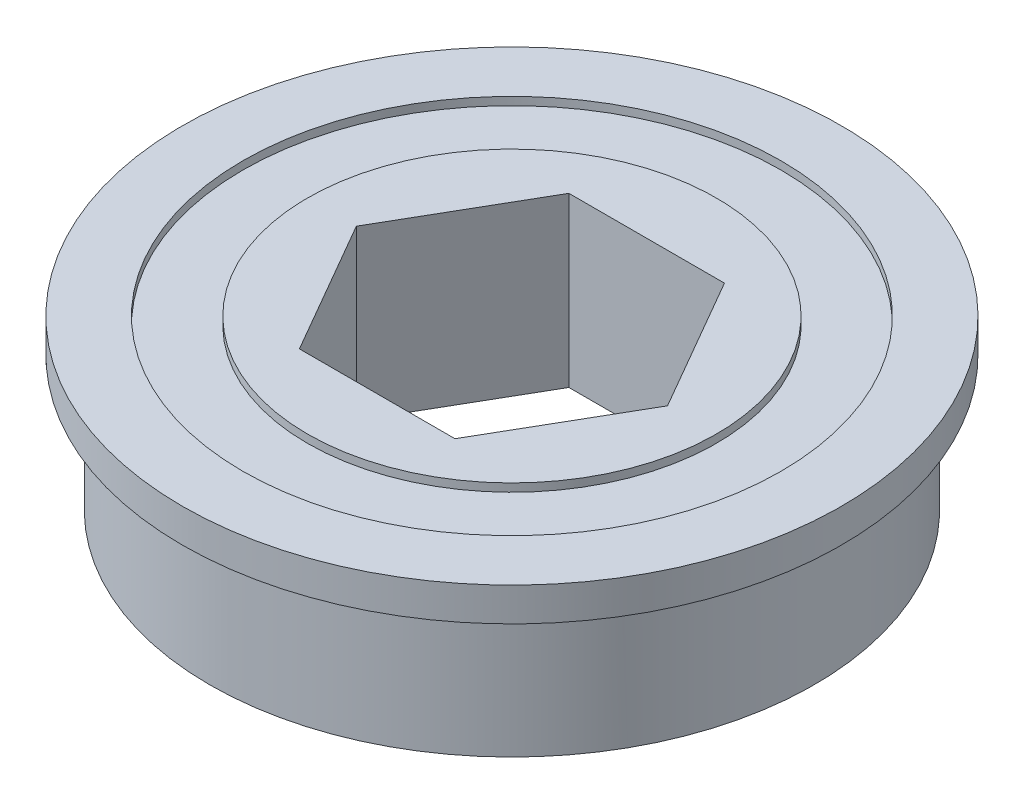
ISO-10303-21;
HEADER;
FILE_DESCRIPTION(('STEP AP214'),'2;1');
FILE_NAME('part.step','',(''),(''),'','','');
FILE_SCHEMA(('AUTOMOTIVE_DESIGN { 1 0 10303 214 1 1 1 1 }'));
ENDSEC;
DATA;
#1=APPLICATION_CONTEXT('core data for automotive mechanical design processes');
#2=APPLICATION_PROTOCOL_DEFINITION('international standard','automotive_design',2000,#1);
#3=PRODUCT_CONTEXT('',#1,'mechanical');
#4=PRODUCT('Part','Part','',(#3));
#5=PRODUCT_RELATED_PRODUCT_CATEGORY('part','',(#4));
#6=PRODUCT_DEFINITION_FORMATION('','',#4);
#7=PRODUCT_DEFINITION_CONTEXT('part definition',#1,'design');
#8=PRODUCT_DEFINITION('design','',#6,#7);
#9=PRODUCT_DEFINITION_SHAPE('','',#8);
#10=(LENGTH_UNIT() NAMED_UNIT(*) SI_UNIT(.MILLI.,.METRE.));
#11=(NAMED_UNIT(*) PLANE_ANGLE_UNIT() SI_UNIT($,.RADIAN.));
#12=(NAMED_UNIT(*) SI_UNIT($,.STERADIAN.) SOLID_ANGLE_UNIT());
#13=UNCERTAINTY_MEASURE_WITH_UNIT(LENGTH_MEASURE(1.E-05),#10,'distance_accuracy_value','');
#14=(GEOMETRIC_REPRESENTATION_CONTEXT(3) GLOBAL_UNCERTAINTY_ASSIGNED_CONTEXT((#13)) GLOBAL_UNIT_ASSIGNED_CONTEXT((#10,
#11,#12)) REPRESENTATION_CONTEXT('',''));
#15=CARTESIAN_POINT('',(0.,0.,0.));
#16=DIRECTION('',(0.,0.,1.));
#17=DIRECTION('',(1.,0.,0.));
#18=AXIS2_PLACEMENT_3D('',#15,#16,#17);
#19=CARTESIAN_POINT('',(0.,0.,0.));
#20=DIRECTION('',(0.,1.,0.));
#21=DIRECTION('',(0.,0.,1.));
#22=AXIS2_PLACEMENT_3D('',#19,#20,#21);
#23=CYLINDRICAL_SURFACE('',#22,12.7);
#24=CARTESIAN_POINT('',(0.,0.381,0.));
#25=DIRECTION('',(0.,1.,0.));
#26=DIRECTION('',(0.,0.,1.));
#27=AXIS2_PLACEMENT_3D('',#24,#25,#26);
#28=CIRCLE('',#27,12.7);
#29=CARTESIAN_POINT('',(0.,0.381,12.7));
#30=VERTEX_POINT('',#29);
#31=EDGE_CURVE('E145',#30,#30,#28,.F.);
#32=ORIENTED_EDGE('',*,*,#31,.F.);
#33=EDGE_LOOP('',(#32));
#34=FACE_BOUND('',#33,.T.);
#35=CARTESIAN_POINT('',(0.,0.,0.));
#36=DIRECTION('',(0.,1.,0.));
#37=DIRECTION('',(0.,0.,1.));
#38=AXIS2_PLACEMENT_3D('',#35,#36,#37);
#39=CIRCLE('',#38,12.7);
#40=CARTESIAN_POINT('',(0.,0.,12.7));
#41=VERTEX_POINT('',#40);
#42=EDGE_CURVE('E141',#41,#41,#39,.T.);
#43=ORIENTED_EDGE('',*,*,#42,.F.);
#44=EDGE_LOOP('',(#43));
#45=FACE_BOUND('',#44,.T.);
#46=ADVANCED_FACE('F16',(#34,#45),#23,.F.);
#47=CARTESIAN_POINT('',(9.652,0.381,0.));
#48=DIRECTION('',(0.,-1.,0.));
#49=DIRECTION('',(0.,0.,-1.));
#50=AXIS2_PLACEMENT_3D('',#47,#48,#49);
#51=PLANE('',#50);
#52=ORIENTED_EDGE('',*,*,#31,.T.);
#53=EDGE_LOOP('',(#52));
#54=FACE_BOUND('',#53,.T.);
#55=CARTESIAN_POINT('',(0.,0.381,0.));
#56=DIRECTION('',(0.,1.,0.));
#57=DIRECTION('',(0.,0.,1.));
#58=AXIS2_PLACEMENT_3D('',#55,#56,#57);
#59=CIRCLE('',#58,9.652);
#60=CARTESIAN_POINT('',(0.,0.381,9.652));
#61=VERTEX_POINT('',#60);
#62=EDGE_CURVE('E137',#61,#61,#59,.F.);
#63=ORIENTED_EDGE('',*,*,#62,.F.);
#64=EDGE_LOOP('',(#63));
#65=FACE_BOUND('',#64,.T.);
#66=ADVANCED_FACE('F377',(#54,#65),#51,.T.);
#67=CARTESIAN_POINT('',(14.2748,0.,0.));
#68=DIRECTION('',(0.,-1.,0.));
#69=DIRECTION('',(0.,0.,-1.));
#70=AXIS2_PLACEMENT_3D('',#67,#68,#69);
#71=PLANE('',#70);
#72=CARTESIAN_POINT('',(0.,0.,0.));
#73=DIRECTION('',(0.,1.,0.));
#74=DIRECTION('',(0.,0.,1.));
#75=AXIS2_PLACEMENT_3D('',#72,#73,#74);
#76=CIRCLE('',#75,14.2748);
#77=CARTESIAN_POINT('',(0.,0.,14.2748));
#78=VERTEX_POINT('',#77);
#79=EDGE_CURVE('E133',#78,#78,#76,.T.);
#80=ORIENTED_EDGE('',*,*,#79,.F.);
#81=EDGE_LOOP('',(#80));
#82=FACE_BOUND('',#81,.T.);
#83=ORIENTED_EDGE('',*,*,#42,.T.);
#84=EDGE_LOOP('',(#83));
#85=FACE_BOUND('',#84,.T.);
#86=ADVANCED_FACE('F368',(#82,#85),#71,.T.);
#87=CARTESIAN_POINT('',(0.,0.,0.));
#88=DIRECTION('',(0.,1.,0.));
#89=DIRECTION('',(0.,0.,1.));
#90=AXIS2_PLACEMENT_3D('',#87,#88,#89);
#91=CYLINDRICAL_SURFACE('',#90,9.652);
#92=CARTESIAN_POINT('',(0.,0.,0.));
#93=DIRECTION('',(0.,1.,0.));
#94=DIRECTION('',(0.,0.,1.));
#95=AXIS2_PLACEMENT_3D('',#92,#93,#94);
#96=CIRCLE('',#95,9.652);
#97=CARTESIAN_POINT('',(0.,0.,9.652));
#98=VERTEX_POINT('',#97);
#99=EDGE_CURVE('E107',#98,#98,#96,.F.);
#100=ORIENTED_EDGE('',*,*,#99,.F.);
#101=EDGE_LOOP('',(#100));
#102=FACE_BOUND('',#101,.T.);
#103=ORIENTED_EDGE('',*,*,#62,.T.);
#104=EDGE_LOOP('',(#103));
#105=FACE_BOUND('',#104,.T.);
#106=ADVANCED_FACE('F359',(#102,#105),#91,.T.);
#107=CARTESIAN_POINT('',(0.,0.,0.));
#108=DIRECTION('',(0.,1.,0.));
#109=DIRECTION('',(0.,0.,1.));
#110=AXIS2_PLACEMENT_3D('',#107,#108,#109);
#111=CYLINDRICAL_SURFACE('',#110,14.2748);
#112=ORIENTED_EDGE('',*,*,#79,.T.);
#113=EDGE_LOOP('',(#112));
#114=FACE_BOUND('',#113,.T.);
#115=CARTESIAN_POINT('',(0.,5.6,0.));
#116=DIRECTION('',(0.,-1.,0.));
#117=DIRECTION('',(0.,0.,-1.));
#118=AXIS2_PLACEMENT_3D('',#115,#116,#117);
#119=CIRCLE('',#118,14.2748);
#120=CARTESIAN_POINT('',(0.,5.6,-14.2748));
#121=VERTEX_POINT('',#120);
#122=EDGE_CURVE('E85',#121,#121,#119,.F.);
#123=ORIENTED_EDGE('',*,*,#122,.F.);
#124=EDGE_LOOP('',(#123));
#125=FACE_BOUND('',#124,.T.);
#126=ADVANCED_FACE('F350',(#114,#125),#111,.T.);
#127=CARTESIAN_POINT('',(9.652,0.,0.));
#128=DIRECTION('',(0.,-1.,0.));
#129=DIRECTION('',(0.,0.,-1.));
#130=AXIS2_PLACEMENT_3D('',#127,#128,#129);
#131=PLANE('',#130);
#132=ORIENTED_EDGE('',*,*,#99,.T.);
#133=EDGE_LOOP('',(#132));
#134=FACE_BOUND('',#133,.T.);
#135=DIRECTION('',(1.,0.,0.));
#136=VECTOR('',#135,1.);
#137=CARTESIAN_POINT('',(-3.67194771204601,0.,6.36));
#138=LINE('',#137,#136);
#139=CARTESIAN_POINT('',(-3.67194771204601,0.,6.36));
#140=VERTEX_POINT('',#139);
#141=CARTESIAN_POINT('',(3.67194771204602,0.,6.36));
#142=VERTEX_POINT('',#141);
#143=EDGE_CURVE('E62',#140,#142,#138,.T.);
#144=ORIENTED_EDGE('',*,*,#143,.T.);
#145=DIRECTION('',(0.5,0.,-0.866025403784439));
#146=VECTOR('',#145,1.);
#147=CARTESIAN_POINT('',(3.67194771204602,0.,6.36));
#148=LINE('',#147,#146);
#149=CARTESIAN_POINT('',(7.34389542409204,0.,0.));
#150=VERTEX_POINT('',#149);
#151=EDGE_CURVE('E64',#142,#150,#148,.T.);
#152=ORIENTED_EDGE('',*,*,#151,.T.);
#153=DIRECTION('',(-0.5,0.,-0.866025403784439));
#154=VECTOR('',#153,1.);
#155=CARTESIAN_POINT('',(7.34389542409204,0.,0.));
#156=LINE('',#155,#154);
#157=CARTESIAN_POINT('',(3.67194771204602,0.,-6.36));
#158=VERTEX_POINT('',#157);
#159=EDGE_CURVE('E67',#150,#158,#156,.T.);
#160=ORIENTED_EDGE('',*,*,#159,.T.);
#161=DIRECTION('',(-1.,0.,0.));
#162=VECTOR('',#161,1.);
#163=CARTESIAN_POINT('',(3.67194771204602,0.,-6.36));
#164=LINE('',#163,#162);
#165=CARTESIAN_POINT('',(-3.67194771204602,0.,-6.36));
#166=VERTEX_POINT('',#165);
#167=EDGE_CURVE('E218',#158,#166,#164,.T.);
#168=ORIENTED_EDGE('',*,*,#167,.T.);
#169=DIRECTION('',(-0.5,0.,0.866025403784439));
#170=VECTOR('',#169,1.);
#171=CARTESIAN_POINT('',(-3.67194771204602,0.,-6.36));
#172=LINE('',#171,#170);
#173=CARTESIAN_POINT('',(-7.34389542409204,0.,0.));
#174=VERTEX_POINT('',#173);
#175=EDGE_CURVE('E227',#166,#174,#172,.T.);
#176=ORIENTED_EDGE('',*,*,#175,.T.);
#177=DIRECTION('',(0.5,0.,0.866025403784439));
#178=VECTOR('',#177,1.);
#179=CARTESIAN_POINT('',(-7.34389542409204,0.,0.));
#180=LINE('',#179,#178);
#181=EDGE_CURVE('E234',#174,#140,#180,.T.);
#182=ORIENTED_EDGE('',*,*,#181,.T.);
#183=EDGE_LOOP('',(#144,#152,#160,#168,#176,#182));
#184=FACE_BOUND('',#183,.T.);
#185=ADVANCED_FACE('F66',(#134,#184),#131,.T.);
#186=CARTESIAN_POINT('',(0.,5.6,0.));
#187=DIRECTION('',(0.,-1.,0.));
#188=DIRECTION('',(0.,0.,-1.));
#189=AXIS2_PLACEMENT_3D('',#186,#187,#188);
#190=CONICAL_SURFACE('',#189,14.2748,0.523598775598298);
#191=CARTESIAN_POINT('',(0.,5.975,0.));
#192=DIRECTION('',(0.,1.,0.));
#193=DIRECTION('',(0.,0.,1.));
#194=AXIS2_PLACEMENT_3D('',#191,#192,#193);
#195=CIRCLE('',#194,14.0582936490539);
#196=CARTESIAN_POINT('',(0.,5.975,14.0582936490539));
#197=VERTEX_POINT('',#196);
#198=EDGE_CURVE('E99',#197,#197,#195,.F.);
#199=ORIENTED_EDGE('',*,*,#198,.T.);
#200=EDGE_LOOP('',(#199));
#201=FACE_BOUND('',#200,.T.);
#202=ORIENTED_EDGE('',*,*,#122,.T.);
#203=EDGE_LOOP('',(#202));
#204=FACE_BOUND('',#203,.T.);
#205=ADVANCED_FACE('F334',(#201,#204),#190,.T.);
#206=CARTESIAN_POINT('',(7.34389542409204,0.,0.));
#207=DIRECTION('',(0.866025403784439,0.,-0.5));
#208=DIRECTION('',(-0.5,0.,-0.866025403784439));
#209=AXIS2_PLACEMENT_3D('',#206,#207,#208);
#210=PLANE('',#209);
#211=DIRECTION('',(0.,1.,0.));
#212=VECTOR('',#211,1.);
#213=CARTESIAN_POINT('',(3.67194771204602,0.,-6.36));
#214=LINE('',#213,#212);
#215=CARTESIAN_POINT('',(3.67194771204602,7.9375,-6.36));
#216=VERTEX_POINT('',#215);
#217=EDGE_CURVE('E82',#216,#158,#214,.F.);
#218=ORIENTED_EDGE('',*,*,#217,.T.);
#219=ORIENTED_EDGE('',*,*,#159,.F.);
#220=DIRECTION('',(0.,1.,0.));
#221=VECTOR('',#220,1.);
#222=CARTESIAN_POINT('',(7.34389542409204,0.,0.));
#223=LINE('',#222,#221);
#224=CARTESIAN_POINT('',(7.34389542409204,7.9375,0.));
#225=VERTEX_POINT('',#224);
#226=EDGE_CURVE('E74',#150,#225,#223,.T.);
#227=ORIENTED_EDGE('',*,*,#226,.T.);
#228=DIRECTION('',(0.5,0.,0.866025403784438));
#229=VECTOR('',#228,1.);
#230=CARTESIAN_POINT('',(3.67194771204602,7.9375,-6.36));
#231=LINE('',#230,#229);
#232=EDGE_CURVE('E103',#216,#225,#231,.T.);
#233=ORIENTED_EDGE('',*,*,#232,.F.);
#234=EDGE_LOOP('',(#218,#219,#227,#233));
#235=FACE_BOUND('',#234,.T.);
#236=ADVANCED_FACE('F78',(#235),#210,.F.);
#237=CARTESIAN_POINT('',(3.67194771204602,0.,6.36));
#238=DIRECTION('',(0.866025403784439,0.,0.5));
#239=DIRECTION('',(0.5,0.,-0.866025403784439));
#240=AXIS2_PLACEMENT_3D('',#237,#238,#239);
#241=PLANE('',#240);
#242=ORIENTED_EDGE('',*,*,#226,.F.);
#243=ORIENTED_EDGE('',*,*,#151,.F.);
#244=DIRECTION('',(0.,1.,0.));
#245=VECTOR('',#244,1.);
#246=CARTESIAN_POINT('',(3.67194771204602,0.,6.36));
#247=LINE('',#246,#245);
#248=CARTESIAN_POINT('',(3.67194771204602,7.9375,6.36));
#249=VERTEX_POINT('',#248);
#250=EDGE_CURVE('E95',#142,#249,#247,.T.);
#251=ORIENTED_EDGE('',*,*,#250,.T.);
#252=DIRECTION('',(-0.5,0.,0.866025403784439));
#253=VECTOR('',#252,1.);
#254=CARTESIAN_POINT('',(7.34389542409204,7.9375,0.));
#255=LINE('',#254,#253);
#256=EDGE_CURVE('E89',#225,#249,#255,.T.);
#257=ORIENTED_EDGE('',*,*,#256,.F.);
#258=EDGE_LOOP('',(#242,#243,#251,#257));
#259=FACE_BOUND('',#258,.T.);
#260=ADVANCED_FACE('F87',(#259),#241,.F.);
#261=CARTESIAN_POINT('',(-3.67194771204601,0.,6.36));
#262=DIRECTION('',(0.,0.,1.));
#263=DIRECTION('',(1.,0.,0.));
#264=AXIS2_PLACEMENT_3D('',#261,#262,#263);
#265=PLANE('',#264);
#266=ORIENTED_EDGE('',*,*,#250,.F.);
#267=ORIENTED_EDGE('',*,*,#143,.F.);
#268=DIRECTION('',(0.,1.,0.));
#269=VECTOR('',#268,1.);
#270=CARTESIAN_POINT('',(-3.67194771204601,0.,6.36));
#271=LINE('',#270,#269);
#272=CARTESIAN_POINT('',(-3.67194771204601,7.9375,6.36));
#273=VERTEX_POINT('',#272);
#274=EDGE_CURVE('E230',#140,#273,#271,.T.);
#275=ORIENTED_EDGE('',*,*,#274,.T.);
#276=DIRECTION('',(1.,0.,0.));
#277=VECTOR('',#276,1.);
#278=CARTESIAN_POINT('',(6.35,7.9375,6.36));
#279=LINE('',#278,#277);
#280=EDGE_CURVE('E207',#249,#273,#279,.F.);
#281=ORIENTED_EDGE('',*,*,#280,.F.);
#282=EDGE_LOOP('',(#266,#267,#275,#281));
#283=FACE_BOUND('',#282,.T.);
#284=ADVANCED_FACE('F242',(#283),#265,.F.);
#285=CARTESIAN_POINT('',(-7.34389542409204,0.,0.));
#286=DIRECTION('',(-0.866025403784439,0.,0.5));
#287=DIRECTION('',(0.5,0.,0.866025403784439));
#288=AXIS2_PLACEMENT_3D('',#285,#286,#287);
#289=PLANE('',#288);
#290=ORIENTED_EDGE('',*,*,#274,.F.);
#291=ORIENTED_EDGE('',*,*,#181,.F.);
#292=DIRECTION('',(0.,1.,0.));
#293=VECTOR('',#292,1.);
#294=CARTESIAN_POINT('',(-7.34389542409204,0.,0.));
#295=LINE('',#294,#293);
#296=CARTESIAN_POINT('',(-7.34389542409204,7.9375,0.));
#297=VERTEX_POINT('',#296);
#298=EDGE_CURVE('E223',#174,#297,#295,.T.);
#299=ORIENTED_EDGE('',*,*,#298,.T.);
#300=DIRECTION('',(-0.5,0.,-0.866025403784439));
#301=VECTOR('',#300,1.);
#302=CARTESIAN_POINT('',(-3.67194771204601,7.9375,6.36));
#303=LINE('',#302,#301);
#304=EDGE_CURVE('E203',#273,#297,#303,.T.);
#305=ORIENTED_EDGE('',*,*,#304,.F.);
#306=EDGE_LOOP('',(#290,#291,#299,#305));
#307=FACE_BOUND('',#306,.T.);
#308=ADVANCED_FACE('F258',(#307),#289,.F.);
#309=CARTESIAN_POINT('',(-3.67194771204602,0.,-6.36));
#310=DIRECTION('',(-0.866025403784439,0.,-0.5));
#311=DIRECTION('',(-0.5,0.,0.866025403784439));
#312=AXIS2_PLACEMENT_3D('',#309,#310,#311);
#313=PLANE('',#312);
#314=ORIENTED_EDGE('',*,*,#298,.F.);
#315=ORIENTED_EDGE('',*,*,#175,.F.);
#316=DIRECTION('',(0.,1.,0.));
#317=VECTOR('',#316,1.);
#318=CARTESIAN_POINT('',(-3.67194771204602,0.,-6.36));
#319=LINE('',#318,#317);
#320=CARTESIAN_POINT('',(-3.67194771204602,7.9375,-6.36));
#321=VERTEX_POINT('',#320);
#322=EDGE_CURVE('E104',#166,#321,#319,.T.);
#323=ORIENTED_EDGE('',*,*,#322,.T.);
#324=DIRECTION('',(0.5,0.,-0.866025403784439));
#325=VECTOR('',#324,1.);
#326=CARTESIAN_POINT('',(-7.34389542409204,7.9375,0.));
#327=LINE('',#326,#325);
#328=EDGE_CURVE('E199',#297,#321,#327,.T.);
#329=ORIENTED_EDGE('',*,*,#328,.F.);
#330=EDGE_LOOP('',(#314,#315,#323,#329));
#331=FACE_BOUND('',#330,.T.);
#332=ADVANCED_FACE('F254',(#331),#313,.F.);
#333=CARTESIAN_POINT('',(3.67194771204602,0.,-6.36));
#334=DIRECTION('',(0.,0.,-1.));
#335=DIRECTION('',(-1.,0.,0.));
#336=AXIS2_PLACEMENT_3D('',#333,#334,#335);
#337=PLANE('',#336);
#338=ORIENTED_EDGE('',*,*,#322,.F.);
#339=ORIENTED_EDGE('',*,*,#167,.F.);
#340=ORIENTED_EDGE('',*,*,#217,.F.);
#341=DIRECTION('',(1.,0.,0.));
#342=VECTOR('',#341,1.);
#343=CARTESIAN_POINT('',(6.35,7.9375,-6.36));
#344=LINE('',#343,#342);
#345=EDGE_CURVE('E129',#321,#216,#344,.T.);
#346=ORIENTED_EDGE('',*,*,#345,.F.);
#347=EDGE_LOOP('',(#338,#339,#340,#346));
#348=FACE_BOUND('',#347,.T.);
#349=ADVANCED_FACE('F249',(#348),#337,.F.);
#350=CARTESIAN_POINT('',(6.35,7.9375,0.));
#351=DIRECTION('',(0.,1.,0.));
#352=DIRECTION('',(0.,0.,1.));
#353=AXIS2_PLACEMENT_3D('',#350,#351,#352);
#354=PLANE('',#353);
#355=CARTESIAN_POINT('',(0.,7.9375,0.));
#356=DIRECTION('',(0.,1.,0.));
#357=DIRECTION('',(0.,0.,1.));
#358=AXIS2_PLACEMENT_3D('',#355,#356,#357);
#359=CIRCLE('',#358,9.652);
#360=CARTESIAN_POINT('',(0.,7.9375,9.652));
#361=VERTEX_POINT('',#360);
#362=EDGE_CURVE('E124',#361,#361,#359,.F.);
#363=ORIENTED_EDGE('',*,*,#362,.F.);
#364=EDGE_LOOP('',(#363));
#365=FACE_BOUND('',#364,.T.);
#366=ORIENTED_EDGE('',*,*,#328,.T.);
#367=ORIENTED_EDGE('',*,*,#345,.T.);
#368=ORIENTED_EDGE('',*,*,#232,.T.);
#369=ORIENTED_EDGE('',*,*,#256,.T.);
#370=ORIENTED_EDGE('',*,*,#280,.T.);
#371=ORIENTED_EDGE('',*,*,#304,.T.);
#372=EDGE_LOOP('',(#366,#367,#368,#369,#370,#371));
#373=FACE_BOUND('',#372,.T.);
#374=ADVANCED_FACE('F183',(#365,#373),#354,.T.);
#375=CARTESIAN_POINT('',(0.,6.1,0.));
#376=DIRECTION('',(0.,1.,0.));
#377=DIRECTION('',(0.,0.,1.));
#378=AXIS2_PLACEMENT_3D('',#375,#376,#377);
#379=TOROIDAL_SURFACE('',#378,14.2748,0.25);
#380=ORIENTED_EDGE('',*,*,#198,.F.);
#381=EDGE_LOOP('',(#380));
#382=FACE_BOUND('',#381,.T.);
#383=CARTESIAN_POINT('',(0.,6.35,0.));
#384=DIRECTION('',(0.,-1.,0.));
#385=DIRECTION('',(0.,0.,-1.));
#386=AXIS2_PLACEMENT_3D('',#383,#384,#385);
#387=CIRCLE('',#386,14.2748);
#388=CARTESIAN_POINT('',(0.,6.35,14.2748));
#389=VERTEX_POINT('',#388);
#390=CARTESIAN_POINT('',(0.,6.35,-14.2748));
#391=VERTEX_POINT('',#390);
#392=EDGE_CURVE('E128',#389,#391,#387,.F.);
#393=ORIENTED_EDGE('',*,*,#392,.F.);
#394=CARTESIAN_POINT('',(0.,6.35,0.));
#395=DIRECTION('',(0.,-1.,0.));
#396=DIRECTION('',(0.,0.,1.));
#397=AXIS2_PLACEMENT_3D('',#394,#395,#396);
#398=CIRCLE('',#397,14.2748);
#399=EDGE_CURVE('E36',#391,#389,#398,.F.);
#400=ORIENTED_EDGE('',*,*,#399,.F.);
#401=EDGE_LOOP('',(#393,#400));
#402=FACE_BOUND('',#401,.T.);
#403=ADVANCED_FACE('F148',(#382,#402),#379,.F.);
#404=CARTESIAN_POINT('',(0.,0.,0.));
#405=DIRECTION('',(0.,1.,0.));
#406=DIRECTION('',(0.,0.,1.));
#407=AXIS2_PLACEMENT_3D('',#404,#405,#406);
#408=CYLINDRICAL_SURFACE('',#407,9.652);
#409=CARTESIAN_POINT('',(0.,7.5565,0.));
#410=DIRECTION('',(0.,1.,0.));
#411=DIRECTION('',(0.,0.,1.));
#412=AXIS2_PLACEMENT_3D('',#409,#410,#411);
#413=CIRCLE('',#412,9.652);
#414=CARTESIAN_POINT('',(0.,7.5565,9.652));
#415=VERTEX_POINT('',#414);
#416=EDGE_CURVE('E120',#415,#415,#413,.F.);
#417=ORIENTED_EDGE('',*,*,#416,.F.);
#418=EDGE_LOOP('',(#417));
#419=FACE_BOUND('',#418,.T.);
#420=ORIENTED_EDGE('',*,*,#362,.T.);
#421=EDGE_LOOP('',(#420));
#422=FACE_BOUND('',#421,.T.);
#423=ADVANCED_FACE('F174',(#419,#422),#408,.T.);
#424=CARTESIAN_POINT('',(15.5575,6.35,0.));
#425=DIRECTION('',(0.,-1.,0.));
#426=DIRECTION('',(0.,0.,-1.));
#427=AXIS2_PLACEMENT_3D('',#424,#425,#426);
#428=PLANE('',#427);
#429=CARTESIAN_POINT('',(0.,6.35,0.));
#430=DIRECTION('',(0.,1.,0.));
#431=DIRECTION('',(0.,0.,1.));
#432=AXIS2_PLACEMENT_3D('',#429,#430,#431);
#433=CIRCLE('',#432,15.5575);
#434=CARTESIAN_POINT('',(0.,6.35,15.5575));
#435=VERTEX_POINT('',#434);
#436=EDGE_CURVE('E116',#435,#435,#433,.T.);
#437=ORIENTED_EDGE('',*,*,#436,.F.);
#438=EDGE_LOOP('',(#437));
#439=FACE_BOUND('',#438,.T.);
#440=ORIENTED_EDGE('',*,*,#392,.T.);
#441=ORIENTED_EDGE('',*,*,#399,.T.);
#442=EDGE_LOOP('',(#440,#441));
#443=FACE_BOUND('',#442,.T.);
#444=ADVANCED_FACE('F153',(#439,#443),#428,.T.);
#445=CARTESIAN_POINT('',(9.652,7.5565,0.));
#446=DIRECTION('',(0.,1.,0.));
#447=DIRECTION('',(0.,0.,1.));
#448=AXIS2_PLACEMENT_3D('',#445,#446,#447);
#449=PLANE('',#448);
#450=ORIENTED_EDGE('',*,*,#416,.T.);
#451=EDGE_LOOP('',(#450));
#452=FACE_BOUND('',#451,.T.);
#453=CARTESIAN_POINT('',(0.,7.5565,0.));
#454=DIRECTION('',(0.,1.,0.));
#455=DIRECTION('',(0.,0.,1.));
#456=AXIS2_PLACEMENT_3D('',#453,#454,#455);
#457=CIRCLE('',#456,12.7);
#458=CARTESIAN_POINT('',(0.,7.5565,12.7));
#459=VERTEX_POINT('',#458);
#460=EDGE_CURVE('E112',#459,#459,#457,.T.);
#461=ORIENTED_EDGE('',*,*,#460,.T.);
#462=EDGE_LOOP('',(#461));
#463=FACE_BOUND('',#462,.T.);
#464=ADVANCED_FACE('F173',(#452,#463),#449,.T.);
#465=CARTESIAN_POINT('',(0.,0.,0.));
#466=DIRECTION('',(0.,1.,0.));
#467=DIRECTION('',(0.,0.,1.));
#468=AXIS2_PLACEMENT_3D('',#465,#466,#467);
#469=CYLINDRICAL_SURFACE('',#468,15.5575);
#470=ORIENTED_EDGE('',*,*,#436,.T.);
#471=EDGE_LOOP('',(#470));
#472=FACE_BOUND('',#471,.T.);
#473=CARTESIAN_POINT('',(0.,7.9375,0.));
#474=DIRECTION('',(0.,1.,0.));
#475=DIRECTION('',(0.,0.,1.));
#476=AXIS2_PLACEMENT_3D('',#473,#474,#475);
#477=CIRCLE('',#476,15.5575);
#478=CARTESIAN_POINT('',(0.,7.9375,15.5575));
#479=VERTEX_POINT('',#478);
#480=EDGE_CURVE('E28',#479,#479,#477,.T.);
#481=ORIENTED_EDGE('',*,*,#480,.F.);
#482=EDGE_LOOP('',(#481));
#483=FACE_BOUND('',#482,.T.);
#484=ADVANCED_FACE('F277',(#472,#483),#469,.T.);
#485=CARTESIAN_POINT('',(0.,0.,0.));
#486=DIRECTION('',(0.,1.,0.));
#487=DIRECTION('',(0.,0.,1.));
#488=AXIS2_PLACEMENT_3D('',#485,#486,#487);
#489=CYLINDRICAL_SURFACE('',#488,12.7);
#490=CARTESIAN_POINT('',(0.,7.9375,0.));
#491=DIRECTION('',(0.,1.,0.));
#492=DIRECTION('',(0.,0.,1.));
#493=AXIS2_PLACEMENT_3D('',#490,#491,#492);
#494=CIRCLE('',#493,12.7);
#495=CARTESIAN_POINT('',(0.,7.9375,12.7));
#496=VERTEX_POINT('',#495);
#497=EDGE_CURVE('E11',#496,#496,#494,.F.);
#498=ORIENTED_EDGE('',*,*,#497,.F.);
#499=EDGE_LOOP('',(#498));
#500=FACE_BOUND('',#499,.T.);
#501=ORIENTED_EDGE('',*,*,#460,.F.);
#502=EDGE_LOOP('',(#501));
#503=FACE_BOUND('',#502,.T.);
#504=ADVANCED_FACE('F272',(#500,#503),#489,.F.);
#505=CARTESIAN_POINT('',(12.7,7.9375,0.));
#506=DIRECTION('',(0.,1.,0.));
#507=DIRECTION('',(0.,0.,1.));
#508=AXIS2_PLACEMENT_3D('',#505,#506,#507);
#509=PLANE('',#508);
#510=ORIENTED_EDGE('',*,*,#497,.T.);
#511=EDGE_LOOP('',(#510));
#512=FACE_BOUND('',#511,.T.);
#513=ORIENTED_EDGE('',*,*,#480,.T.);
#514=EDGE_LOOP('',(#513));
#515=FACE_BOUND('',#514,.T.);
#516=ADVANCED_FACE('F270',(#512,#515),#509,.T.);
#517=CLOSED_SHELL('',(#46,#66,#86,#106,#126,#185,#205,#236,#260,#284,#308,#332,#349,#374,#403,
#423,#444,#464,#484,#504,#516));
#518=MANIFOLD_SOLID_BREP('B1',#517);
#519=ADVANCED_BREP_SHAPE_REPRESENTATION('',(#18,#518),#14);
#520=SHAPE_DEFINITION_REPRESENTATION(#9,#519);
ENDSEC;
END-ISO-10303-21;
